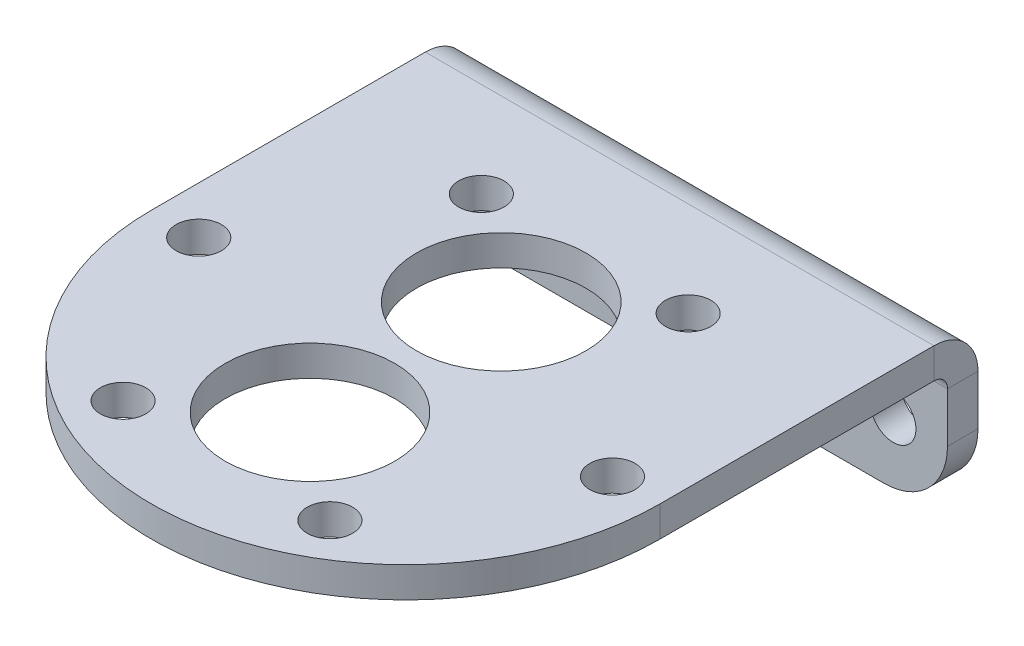
ISO-10303-21;
HEADER;
FILE_DESCRIPTION(('STEP AP214'),'2;1');
FILE_NAME('part.step','',(''),(''),'','','');
FILE_SCHEMA(('AUTOMOTIVE_DESIGN { 1 0 10303 214 1 1 1 1 }'));
ENDSEC;
DATA;
#1=APPLICATION_CONTEXT('core data for automotive mechanical design processes');
#2=APPLICATION_PROTOCOL_DEFINITION('international standard','automotive_design',2000,#1);
#3=PRODUCT_CONTEXT('',#1,'mechanical');
#4=PRODUCT('Part','Part','',(#3));
#5=PRODUCT_RELATED_PRODUCT_CATEGORY('part','',(#4));
#6=PRODUCT_DEFINITION_FORMATION('','',#4);
#7=PRODUCT_DEFINITION_CONTEXT('part definition',#1,'design');
#8=PRODUCT_DEFINITION('design','',#6,#7);
#9=PRODUCT_DEFINITION_SHAPE('','',#8);
#10=(LENGTH_UNIT() NAMED_UNIT(*) SI_UNIT(.MILLI.,.METRE.));
#11=(NAMED_UNIT(*) PLANE_ANGLE_UNIT() SI_UNIT($,.RADIAN.));
#12=(NAMED_UNIT(*) SI_UNIT($,.STERADIAN.) SOLID_ANGLE_UNIT());
#13=UNCERTAINTY_MEASURE_WITH_UNIT(LENGTH_MEASURE(1.E-05),#10,'distance_accuracy_value','');
#14=(GEOMETRIC_REPRESENTATION_CONTEXT(3) GLOBAL_UNCERTAINTY_ASSIGNED_CONTEXT((#13)) GLOBAL_UNIT_ASSIGNED_CONTEXT((#10,
#11,#12)) REPRESENTATION_CONTEXT('',''));
#15=CARTESIAN_POINT('',(0.,0.,0.));
#16=DIRECTION('',(0.,0.,1.));
#17=DIRECTION('',(1.,0.,0.));
#18=AXIS2_PLACEMENT_3D('',#15,#16,#17);
#19=CARTESIAN_POINT('',(19.05,-2.286,0.));
#20=DIRECTION('',(1.,0.,0.));
#21=DIRECTION('',(0.,0.,-1.));
#22=AXIS2_PLACEMENT_3D('',#19,#20,#21);
#23=PLANE('',#22);
#24=DIRECTION('',(0.,0.,-1.));
#25=VECTOR('',#24,1.);
#26=CARTESIAN_POINT('',(19.05,-2.286,0.));
#27=LINE('',#26,#25);
#28=CARTESIAN_POINT('',(19.05,-2.286,0.));
#29=VERTEX_POINT('',#28);
#30=CARTESIAN_POINT('',(19.05,-2.28600000000001,-20.5232));
#31=VERTEX_POINT('',#30);
#32=EDGE_CURVE('E201',#29,#31,#27,.T.);
#33=ORIENTED_EDGE('',*,*,#32,.T.);
#34=DIRECTION('',(0.,1.,0.));
#35=VECTOR('',#34,1.);
#36=CARTESIAN_POINT('',(19.05,-2.28600000000001,-20.5232));
#37=LINE('',#36,#35);
#38=CARTESIAN_POINT('',(19.05,0.,-20.5232));
#39=VERTEX_POINT('',#38);
#40=EDGE_CURVE('E186',#31,#39,#37,.T.);
#41=ORIENTED_EDGE('',*,*,#40,.T.);
#42=DIRECTION('',(0.,0.,-1.));
#43=VECTOR('',#42,1.);
#44=CARTESIAN_POINT('',(19.05,0.,0.));
#45=LINE('',#44,#43);
#46=CARTESIAN_POINT('',(19.05,0.,0.));
#47=VERTEX_POINT('',#46);
#48=EDGE_CURVE('E210',#47,#39,#45,.T.);
#49=ORIENTED_EDGE('',*,*,#48,.F.);
#50=DIRECTION('',(0.,1.,0.));
#51=VECTOR('',#50,1.);
#52=CARTESIAN_POINT('',(19.05,-2.286,0.));
#53=LINE('',#52,#51);
#54=EDGE_CURVE('E207',#29,#47,#53,.T.);
#55=ORIENTED_EDGE('',*,*,#54,.F.);
#56=EDGE_LOOP('',(#33,#41,#49,#55));
#57=FACE_BOUND('',#56,.T.);
#58=ADVANCED_FACE('F59',(#57),#23,.T.);
#59=CARTESIAN_POINT('',(0.,-2.286,0.));
#60=DIRECTION('',(0.,1.,0.));
#61=DIRECTION('',(0.,0.,1.));
#62=AXIS2_PLACEMENT_3D('',#59,#60,#61);
#63=PLANE('',#62);
#64=CARTESIAN_POINT('',(0.,-2.286,7.1628));
#65=DIRECTION('',(0.,-1.,0.));
#66=DIRECTION('',(0.,0.,-1.));
#67=AXIS2_PLACEMENT_3D('',#64,#65,#66);
#68=CIRCLE('',#67,6.35);
#69=CARTESIAN_POINT('',(0.,-2.286,0.812800000000004));
#70=VERTEX_POINT('',#69);
#71=EDGE_CURVE('E227',#70,#70,#68,.T.);
#72=ORIENTED_EDGE('',*,*,#71,.F.);
#73=EDGE_LOOP('',(#72));
#74=FACE_BOUND('',#73,.T.);
#75=CARTESIAN_POINT('',(0.,-2.286,-7.1628));
#76=DIRECTION('',(0.,-1.,0.));
#77=DIRECTION('',(0.,0.,-1.));
#78=AXIS2_PLACEMENT_3D('',#75,#76,#77);
#79=CIRCLE('',#78,6.35);
#80=CARTESIAN_POINT('',(0.,-2.286,-13.5128));
#81=VERTEX_POINT('',#80);
#82=EDGE_CURVE('E223',#81,#81,#79,.T.);
#83=ORIENTED_EDGE('',*,*,#82,.F.);
#84=EDGE_LOOP('',(#83));
#85=FACE_BOUND('',#84,.T.);
#86=CARTESIAN_POINT('',(7.74699999999999,-2.286,13.4181976062361));
#87=DIRECTION('',(0.,1.,0.));
#88=DIRECTION('',(0.,0.,1.));
#89=AXIS2_PLACEMENT_3D('',#86,#87,#88);
#90=CIRCLE('',#89,1.7);
#91=CARTESIAN_POINT('',(7.74699999999999,-2.286,15.1181976062361));
#92=VERTEX_POINT('',#91);
#93=EDGE_CURVE('E410',#92,#92,#90,.T.);
#94=ORIENTED_EDGE('',*,*,#93,.T.);
#95=EDGE_LOOP('',(#94));
#96=FACE_BOUND('',#95,.T.);
#97=CARTESIAN_POINT('',(-7.74700000000001,-2.286,13.4181976062361));
#98=DIRECTION('',(0.,1.,0.));
#99=DIRECTION('',(0.,0.,1.));
#100=AXIS2_PLACEMENT_3D('',#97,#98,#99);
#101=CIRCLE('',#100,1.7);
#102=CARTESIAN_POINT('',(-7.74700000000001,-2.286,15.1181976062361));
#103=VERTEX_POINT('',#102);
#104=EDGE_CURVE('E406',#103,#103,#101,.T.);
#105=ORIENTED_EDGE('',*,*,#104,.T.);
#106=EDGE_LOOP('',(#105));
#107=FACE_BOUND('',#106,.T.);
#108=CARTESIAN_POINT('',(-15.494,-2.286,0.));
#109=DIRECTION('',(0.,1.,0.));
#110=DIRECTION('',(0.,0.,1.));
#111=AXIS2_PLACEMENT_3D('',#108,#109,#110);
#112=CIRCLE('',#111,1.7);
#113=CARTESIAN_POINT('',(-15.494,-2.286,1.7));
#114=VERTEX_POINT('',#113);
#115=EDGE_CURVE('E402',#114,#114,#112,.T.);
#116=ORIENTED_EDGE('',*,*,#115,.T.);
#117=EDGE_LOOP('',(#116));
#118=FACE_BOUND('',#117,.T.);
#119=CARTESIAN_POINT('',(-7.747,-2.286,-13.4181976062361));
#120=DIRECTION('',(0.,1.,0.));
#121=DIRECTION('',(0.,0.,1.));
#122=AXIS2_PLACEMENT_3D('',#119,#120,#121);
#123=CIRCLE('',#122,1.7);
#124=CARTESIAN_POINT('',(-7.747,-2.286,-11.7181976062361));
#125=VERTEX_POINT('',#124);
#126=EDGE_CURVE('E398',#125,#125,#123,.T.);
#127=ORIENTED_EDGE('',*,*,#126,.T.);
#128=EDGE_LOOP('',(#127));
#129=FACE_BOUND('',#128,.T.);
#130=CARTESIAN_POINT('',(7.747,-2.286,-13.4181976062361));
#131=DIRECTION('',(0.,1.,0.));
#132=DIRECTION('',(0.,0.,1.));
#133=AXIS2_PLACEMENT_3D('',#130,#131,#132);
#134=CIRCLE('',#133,1.7);
#135=CARTESIAN_POINT('',(7.747,-2.286,-11.7181976062361));
#136=VERTEX_POINT('',#135);
#137=EDGE_CURVE('E391',#136,#136,#134,.T.);
#138=ORIENTED_EDGE('',*,*,#137,.T.);
#139=EDGE_LOOP('',(#138));
#140=FACE_BOUND('',#139,.T.);
#141=CARTESIAN_POINT('',(15.494,-2.286,0.));
#142=DIRECTION('',(0.,1.,0.));
#143=DIRECTION('',(0.,0.,1.));
#144=AXIS2_PLACEMENT_3D('',#141,#142,#143);
#145=CIRCLE('',#144,1.7);
#146=CARTESIAN_POINT('',(15.494,-2.286,1.7));
#147=VERTEX_POINT('',#146);
#148=EDGE_CURVE('E183',#147,#147,#145,.T.);
#149=ORIENTED_EDGE('',*,*,#148,.T.);
#150=EDGE_LOOP('',(#149));
#151=FACE_BOUND('',#150,.T.);
#152=DIRECTION('',(1.,0.,0.));
#153=VECTOR('',#152,1.);
#154=CARTESIAN_POINT('',(19.05,-2.28600000000001,-20.5232));
#155=LINE('',#154,#153);
#156=CARTESIAN_POINT('',(-19.05,-2.286,-20.5232));
#157=VERTEX_POINT('',#156);
#158=EDGE_CURVE('E190',#31,#157,#155,.F.);
#159=ORIENTED_EDGE('',*,*,#158,.F.);
#160=ORIENTED_EDGE('',*,*,#32,.F.);
#161=CARTESIAN_POINT('',(0.,-2.286,0.));
#162=DIRECTION('',(0.,1.,0.));
#163=DIRECTION('',(0.,0.,1.));
#164=AXIS2_PLACEMENT_3D('',#161,#162,#163);
#165=CIRCLE('',#164,19.05);
#166=CARTESIAN_POINT('',(-19.05,-2.286,0.));
#167=VERTEX_POINT('',#166);
#168=EDGE_CURVE('E198',#167,#29,#165,.T.);
#169=ORIENTED_EDGE('',*,*,#168,.F.);
#170=DIRECTION('',(0.,0.,1.));
#171=VECTOR('',#170,1.);
#172=CARTESIAN_POINT('',(-19.05,-2.286,-23.8252));
#173=LINE('',#172,#171);
#174=EDGE_CURVE('E205',#157,#167,#173,.T.);
#175=ORIENTED_EDGE('',*,*,#174,.F.);
#176=EDGE_LOOP('',(#159,#160,#169,#175));
#177=FACE_BOUND('',#176,.T.);
#178=ADVANCED_FACE('F273',(#74,#85,#96,#107,#118,#129,#140,#151,#177),#63,.F.);
#179=CARTESIAN_POINT('',(0.,0.,0.));
#180=DIRECTION('',(0.,1.,0.));
#181=DIRECTION('',(0.,0.,1.));
#182=AXIS2_PLACEMENT_3D('',#179,#180,#181);
#183=PLANE('',#182);
#184=CARTESIAN_POINT('',(0.,0.,7.1628));
#185=DIRECTION('',(0.,1.,0.));
#186=DIRECTION('',(0.,0.,1.));
#187=AXIS2_PLACEMENT_3D('',#184,#185,#186);
#188=CIRCLE('',#187,6.35);
#189=CARTESIAN_POINT('',(0.,0.,13.5128));
#190=VERTEX_POINT('',#189);
#191=EDGE_CURVE('E224',#190,#190,#188,.T.);
#192=ORIENTED_EDGE('',*,*,#191,.F.);
#193=EDGE_LOOP('',(#192));
#194=FACE_BOUND('',#193,.T.);
#195=CARTESIAN_POINT('',(0.,0.,-7.1628));
#196=DIRECTION('',(0.,1.,0.));
#197=DIRECTION('',(0.,0.,1.));
#198=AXIS2_PLACEMENT_3D('',#195,#196,#197);
#199=CIRCLE('',#198,6.35);
#200=CARTESIAN_POINT('',(0.,0.,-0.812800000000004));
#201=VERTEX_POINT('',#200);
#202=EDGE_CURVE('E219',#201,#201,#199,.T.);
#203=ORIENTED_EDGE('',*,*,#202,.F.);
#204=EDGE_LOOP('',(#203));
#205=FACE_BOUND('',#204,.T.);
#206=CARTESIAN_POINT('',(7.74699999999999,0.,13.4181976062361));
#207=DIRECTION('',(0.,1.,0.));
#208=DIRECTION('',(0.,0.,1.));
#209=AXIS2_PLACEMENT_3D('',#206,#207,#208);
#210=CIRCLE('',#209,1.7);
#211=CARTESIAN_POINT('',(7.74699999999999,0.,15.1181976062361));
#212=VERTEX_POINT('',#211);
#213=EDGE_CURVE('E222',#212,#212,#210,.T.);
#214=ORIENTED_EDGE('',*,*,#213,.F.);
#215=EDGE_LOOP('',(#214));
#216=FACE_BOUND('',#215,.T.);
#217=CARTESIAN_POINT('',(-7.74700000000001,0.,13.4181976062361));
#218=DIRECTION('',(0.,1.,0.));
#219=DIRECTION('',(0.,0.,1.));
#220=AXIS2_PLACEMENT_3D('',#217,#218,#219);
#221=CIRCLE('',#220,1.7);
#222=CARTESIAN_POINT('',(-7.74700000000001,0.,15.1181976062361));
#223=VERTEX_POINT('',#222);
#224=EDGE_CURVE('E375',#223,#223,#221,.T.);
#225=ORIENTED_EDGE('',*,*,#224,.F.);
#226=EDGE_LOOP('',(#225));
#227=FACE_BOUND('',#226,.T.);
#228=CARTESIAN_POINT('',(-15.494,0.,0.));
#229=DIRECTION('',(0.,1.,0.));
#230=DIRECTION('',(0.,0.,1.));
#231=AXIS2_PLACEMENT_3D('',#228,#229,#230);
#232=CIRCLE('',#231,1.7);
#233=CARTESIAN_POINT('',(-15.494,0.,1.7));
#234=VERTEX_POINT('',#233);
#235=EDGE_CURVE('E379',#234,#234,#232,.T.);
#236=ORIENTED_EDGE('',*,*,#235,.F.);
#237=EDGE_LOOP('',(#236));
#238=FACE_BOUND('',#237,.T.);
#239=CARTESIAN_POINT('',(-7.747,0.,-13.4181976062361));
#240=DIRECTION('',(0.,1.,0.));
#241=DIRECTION('',(0.,0.,1.));
#242=AXIS2_PLACEMENT_3D('',#239,#240,#241);
#243=CIRCLE('',#242,1.7);
#244=CARTESIAN_POINT('',(-7.747,0.,-11.7181976062361));
#245=VERTEX_POINT('',#244);
#246=EDGE_CURVE('E383',#245,#245,#243,.T.);
#247=ORIENTED_EDGE('',*,*,#246,.F.);
#248=EDGE_LOOP('',(#247));
#249=FACE_BOUND('',#248,.T.);
#250=CARTESIAN_POINT('',(7.747,0.,-13.4181976062361));
#251=DIRECTION('',(0.,1.,0.));
#252=DIRECTION('',(0.,0.,1.));
#253=AXIS2_PLACEMENT_3D('',#250,#251,#252);
#254=CIRCLE('',#253,1.7);
#255=CARTESIAN_POINT('',(7.747,0.,-11.7181976062361));
#256=VERTEX_POINT('',#255);
#257=EDGE_CURVE('E387',#256,#256,#254,.T.);
#258=ORIENTED_EDGE('',*,*,#257,.F.);
#259=EDGE_LOOP('',(#258));
#260=FACE_BOUND('',#259,.T.);
#261=CARTESIAN_POINT('',(15.494,0.,0.));
#262=DIRECTION('',(0.,1.,0.));
#263=DIRECTION('',(0.,0.,1.));
#264=AXIS2_PLACEMENT_3D('',#261,#262,#263);
#265=CIRCLE('',#264,1.7);
#266=CARTESIAN_POINT('',(15.494,0.,1.7));
#267=VERTEX_POINT('',#266);
#268=EDGE_CURVE('E390',#267,#267,#265,.T.);
#269=ORIENTED_EDGE('',*,*,#268,.F.);
#270=EDGE_LOOP('',(#269));
#271=FACE_BOUND('',#270,.T.);
#272=ORIENTED_EDGE('',*,*,#48,.T.);
#273=DIRECTION('',(1.,0.,0.));
#274=VECTOR('',#273,1.);
#275=CARTESIAN_POINT('',(19.05,0.,-20.5232));
#276=LINE('',#275,#274);
#277=CARTESIAN_POINT('',(-19.05,0.,-20.5232));
#278=VERTEX_POINT('',#277);
#279=EDGE_CURVE('E145',#39,#278,#276,.F.);
#280=ORIENTED_EDGE('',*,*,#279,.T.);
#281=DIRECTION('',(0.,0.,1.));
#282=VECTOR('',#281,1.);
#283=CARTESIAN_POINT('',(-19.05,0.,-23.8252));
#284=LINE('',#283,#282);
#285=CARTESIAN_POINT('',(-19.05,0.,0.));
#286=VERTEX_POINT('',#285);
#287=EDGE_CURVE('E202',#278,#286,#284,.T.);
#288=ORIENTED_EDGE('',*,*,#287,.T.);
#289=CARTESIAN_POINT('',(0.,0.,0.));
#290=DIRECTION('',(0.,1.,0.));
#291=DIRECTION('',(0.,0.,1.));
#292=AXIS2_PLACEMENT_3D('',#289,#290,#291);
#293=CIRCLE('',#292,19.05);
#294=EDGE_CURVE('E196',#286,#47,#293,.T.);
#295=ORIENTED_EDGE('',*,*,#294,.T.);
#296=EDGE_LOOP('',(#272,#280,#288,#295));
#297=FACE_BOUND('',#296,.T.);
#298=ADVANCED_FACE('F280',(#194,#205,#216,#227,#238,#249,#260,#271,#297),#183,.T.);
#299=CARTESIAN_POINT('',(0.,-2.286,0.));
#300=DIRECTION('',(0.,1.,0.));
#301=DIRECTION('',(0.,0.,1.));
#302=AXIS2_PLACEMENT_3D('',#299,#300,#301);
#303=CYLINDRICAL_SURFACE('',#302,19.05);
#304=ORIENTED_EDGE('',*,*,#294,.F.);
#305=DIRECTION('',(0.,1.,0.));
#306=VECTOR('',#305,1.);
#307=CARTESIAN_POINT('',(-19.05,-2.286,0.));
#308=LINE('',#307,#306);
#309=EDGE_CURVE('E214',#167,#286,#308,.T.);
#310=ORIENTED_EDGE('',*,*,#309,.F.);
#311=ORIENTED_EDGE('',*,*,#168,.T.);
#312=ORIENTED_EDGE('',*,*,#54,.T.);
#313=EDGE_LOOP('',(#304,#310,#311,#312));
#314=FACE_BOUND('',#313,.T.);
#315=ADVANCED_FACE('F277',(#314),#303,.T.);
#316=CARTESIAN_POINT('',(-19.05,-2.286,-23.8252));
#317=DIRECTION('',(-1.,0.,0.));
#318=DIRECTION('',(0.,0.,1.));
#319=AXIS2_PLACEMENT_3D('',#316,#317,#318);
#320=PLANE('',#319);
#321=DIRECTION('',(0.,1.,0.));
#322=VECTOR('',#321,1.);
#323=CARTESIAN_POINT('',(-19.05,-2.286,-20.5232));
#324=LINE('',#323,#322);
#325=EDGE_CURVE('E193',#157,#278,#324,.T.);
#326=ORIENTED_EDGE('',*,*,#325,.F.);
#327=ORIENTED_EDGE('',*,*,#174,.T.);
#328=ORIENTED_EDGE('',*,*,#309,.T.);
#329=ORIENTED_EDGE('',*,*,#287,.F.);
#330=EDGE_LOOP('',(#326,#327,#328,#329));
#331=FACE_BOUND('',#330,.T.);
#332=ADVANCED_FACE('F269',(#331),#320,.T.);
#333=CARTESIAN_POINT('',(-19.05,-3.302,-20.5232));
#334=DIRECTION('',(-1.,0.,0.));
#335=DIRECTION('',(0.,-1.,0.));
#336=AXIS2_PLACEMENT_3D('',#333,#334,#335);
#337=PLANE('',#336);
#338=DIRECTION('',(0.,0.,1.));
#339=VECTOR('',#338,1.);
#340=CARTESIAN_POINT('',(-19.05,-3.30199999999998,-23.8252));
#341=LINE('',#340,#339);
#342=CARTESIAN_POINT('',(-19.05,-3.30199999999999,-21.5392));
#343=VERTEX_POINT('',#342);
#344=CARTESIAN_POINT('',(-19.05,-3.30199999999998,-23.8252));
#345=VERTEX_POINT('',#344);
#346=EDGE_CURVE('E180',#343,#345,#341,.F.);
#347=ORIENTED_EDGE('',*,*,#346,.F.);
#348=CARTESIAN_POINT('',(-19.05,-3.302,-20.5232));
#349=DIRECTION('',(1.,0.,0.));
#350=DIRECTION('',(0.,1.,0.));
#351=AXIS2_PLACEMENT_3D('',#348,#349,#350);
#352=CIRCLE('',#351,1.016);
#353=EDGE_CURVE('E148',#157,#343,#352,.F.);
#354=ORIENTED_EDGE('',*,*,#353,.F.);
#355=ORIENTED_EDGE('',*,*,#325,.T.);
#356=CARTESIAN_POINT('',(-19.05,-3.302,-20.5232));
#357=DIRECTION('',(1.,0.,0.));
#358=DIRECTION('',(0.,1.,0.));
#359=AXIS2_PLACEMENT_3D('',#356,#357,#358);
#360=CIRCLE('',#359,3.302);
#361=EDGE_CURVE('E185',#278,#345,#360,.F.);
#362=ORIENTED_EDGE('',*,*,#361,.T.);
#363=EDGE_LOOP('',(#347,#354,#355,#362));
#364=FACE_BOUND('',#363,.T.);
#365=ADVANCED_FACE('F265',(#364),#337,.T.);
#366=CARTESIAN_POINT('',(19.05,-3.30200000000001,-20.5232));
#367=DIRECTION('',(-1.,0.,0.));
#368=DIRECTION('',(0.,-1.,0.));
#369=AXIS2_PLACEMENT_3D('',#366,#367,#368);
#370=PLANE('',#369);
#371=CARTESIAN_POINT('',(19.05,-3.30200000000001,-20.5232));
#372=DIRECTION('',(1.,0.,0.));
#373=DIRECTION('',(0.,1.,0.));
#374=AXIS2_PLACEMENT_3D('',#371,#372,#373);
#375=CIRCLE('',#374,1.016);
#376=CARTESIAN_POINT('',(19.05,-3.302,-21.5392));
#377=VERTEX_POINT('',#376);
#378=EDGE_CURVE('E155',#377,#31,#375,.T.);
#379=ORIENTED_EDGE('',*,*,#378,.F.);
#380=DIRECTION('',(0.,0.,1.));
#381=VECTOR('',#380,1.);
#382=CARTESIAN_POINT('',(19.05,-3.302,-21.5392));
#383=LINE('',#382,#381);
#384=CARTESIAN_POINT('',(19.05,-3.30199999999998,-23.8252));
#385=VERTEX_POINT('',#384);
#386=EDGE_CURVE('E152',#377,#385,#383,.F.);
#387=ORIENTED_EDGE('',*,*,#386,.T.);
#388=CARTESIAN_POINT('',(19.05,-3.30200000000001,-20.5232));
#389=DIRECTION('',(1.,0.,0.));
#390=DIRECTION('',(0.,1.,0.));
#391=AXIS2_PLACEMENT_3D('',#388,#389,#390);
#392=CIRCLE('',#391,3.302);
#393=EDGE_CURVE('E138',#385,#39,#392,.T.);
#394=ORIENTED_EDGE('',*,*,#393,.T.);
#395=ORIENTED_EDGE('',*,*,#40,.F.);
#396=EDGE_LOOP('',(#379,#387,#394,#395));
#397=FACE_BOUND('',#396,.T.);
#398=ADVANCED_FACE('F153',(#397),#370,.F.);
#399=CARTESIAN_POINT('',(19.05,-3.30200000000001,-20.5232));
#400=DIRECTION('',(1.,0.,0.));
#401=DIRECTION('',(0.,0.,-1.));
#402=AXIS2_PLACEMENT_3D('',#399,#400,#401);
#403=CYLINDRICAL_SURFACE('',#402,3.302);
#404=ORIENTED_EDGE('',*,*,#279,.F.);
#405=ORIENTED_EDGE('',*,*,#393,.F.);
#406=DIRECTION('',(1.,0.,0.));
#407=VECTOR('',#406,1.);
#408=CARTESIAN_POINT('',(0.,-3.30199999999998,-23.8252));
#409=LINE('',#408,#407);
#410=EDGE_CURVE('E142',#345,#385,#409,.T.);
#411=ORIENTED_EDGE('',*,*,#410,.F.);
#412=ORIENTED_EDGE('',*,*,#361,.F.);
#413=EDGE_LOOP('',(#404,#405,#411,#412));
#414=FACE_BOUND('',#413,.T.);
#415=ADVANCED_FACE('F140',(#414),#403,.T.);
#416=CARTESIAN_POINT('',(19.05,-3.30200000000001,-20.5232));
#417=DIRECTION('',(1.,0.,0.));
#418=DIRECTION('',(0.,0.,-1.));
#419=AXIS2_PLACEMENT_3D('',#416,#417,#418);
#420=CYLINDRICAL_SURFACE('',#419,1.016);
#421=ORIENTED_EDGE('',*,*,#158,.T.);
#422=ORIENTED_EDGE('',*,*,#353,.T.);
#423=DIRECTION('',(-1.,0.,0.));
#424=VECTOR('',#423,1.);
#425=CARTESIAN_POINT('',(-19.05,-3.30199999999999,-21.5392));
#426=LINE('',#425,#424);
#427=EDGE_CURVE('E157',#343,#377,#426,.F.);
#428=ORIENTED_EDGE('',*,*,#427,.T.);
#429=ORIENTED_EDGE('',*,*,#378,.T.);
#430=EDGE_LOOP('',(#421,#422,#428,#429));
#431=FACE_BOUND('',#430,.T.);
#432=ADVANCED_FACE('F260',(#431),#420,.F.);
#433=CARTESIAN_POINT('',(-19.05,-11.811,-23.8252000000001));
#434=DIRECTION('',(1.,0.,0.));
#435=DIRECTION('',(0.,0.,-1.));
#436=AXIS2_PLACEMENT_3D('',#433,#434,#435);
#437=PLANE('',#436);
#438=DIRECTION('',(0.,-1.,0.));
#439=VECTOR('',#438,1.);
#440=CARTESIAN_POINT('',(-19.05,1.71803815408234E-13,-23.8252));
#441=LINE('',#440,#439);
#442=CARTESIAN_POINT('',(-19.05,-7.03579999999998,-23.8252));
#443=VERTEX_POINT('',#442);
#444=EDGE_CURVE('E164',#443,#345,#441,.F.);
#445=ORIENTED_EDGE('',*,*,#444,.F.);
#446=DIRECTION('',(0.,0.,1.));
#447=VECTOR('',#446,1.);
#448=CARTESIAN_POINT('',(-19.05,-7.03579999999998,-23.8252));
#449=LINE('',#448,#447);
#450=CARTESIAN_POINT('',(-19.05,-7.03579999999999,-21.5392));
#451=VERTEX_POINT('',#450);
#452=EDGE_CURVE('E217',#443,#451,#449,.T.);
#453=ORIENTED_EDGE('',*,*,#452,.T.);
#454=DIRECTION('',(0.,1.,0.));
#455=VECTOR('',#454,1.);
#456=CARTESIAN_POINT('',(-19.05,-11.811,-21.5392000000001));
#457=LINE('',#456,#455);
#458=EDGE_CURVE('E165',#451,#343,#457,.T.);
#459=ORIENTED_EDGE('',*,*,#458,.T.);
#460=ORIENTED_EDGE('',*,*,#346,.T.);
#461=EDGE_LOOP('',(#445,#453,#459,#460));
#462=FACE_BOUND('',#461,.T.);
#463=ADVANCED_FACE('F248',(#462),#437,.F.);
#464=CARTESIAN_POINT('',(19.05,-2.28599999999999,-23.8252));
#465=DIRECTION('',(-1.,0.,0.));
#466=DIRECTION('',(0.,-1.,0.));
#467=AXIS2_PLACEMENT_3D('',#464,#465,#466);
#468=PLANE('',#467);
#469=DIRECTION('',(0.,-1.,0.));
#470=VECTOR('',#469,1.);
#471=CARTESIAN_POINT('',(19.05,-2.286,-21.5392));
#472=LINE('',#471,#470);
#473=CARTESIAN_POINT('',(19.05,-7.0358,-21.5392));
#474=VERTEX_POINT('',#473);
#475=EDGE_CURVE('E176',#377,#474,#472,.T.);
#476=ORIENTED_EDGE('',*,*,#475,.T.);
#477=DIRECTION('',(0.,0.,1.));
#478=VECTOR('',#477,1.);
#479=CARTESIAN_POINT('',(19.05,-7.03579999999999,-23.8252));
#480=LINE('',#479,#478);
#481=CARTESIAN_POINT('',(19.05,-7.03579999999999,-23.8252));
#482=VERTEX_POINT('',#481);
#483=EDGE_CURVE('E13',#474,#482,#480,.F.);
#484=ORIENTED_EDGE('',*,*,#483,.T.);
#485=DIRECTION('',(0.,1.,0.));
#486=VECTOR('',#485,1.);
#487=CARTESIAN_POINT('',(19.05,1.78742709312142E-13,-23.8252));
#488=LINE('',#487,#486);
#489=EDGE_CURVE('E161',#385,#482,#488,.F.);
#490=ORIENTED_EDGE('',*,*,#489,.F.);
#491=ORIENTED_EDGE('',*,*,#386,.F.);
#492=EDGE_LOOP('',(#476,#484,#490,#491));
#493=FACE_BOUND('',#492,.T.);
#494=ADVANCED_FACE('F167',(#493),#468,.F.);
#495=CARTESIAN_POINT('',(0.,1.71803815408234E-13,-23.8252));
#496=DIRECTION('',(0.,0.,-1.));
#497=DIRECTION('',(0.,1.,0.));
#498=AXIS2_PLACEMENT_3D('',#495,#496,#497);
#499=PLANE('',#498);
#500=CARTESIAN_POINT('',(14.986,-7.112,-23.8252));
#501=DIRECTION('',(0.,0.,-1.));
#502=DIRECTION('',(0.,1.,0.));
#503=AXIS2_PLACEMENT_3D('',#500,#501,#502);
#504=CIRCLE('',#503,1.7);
#505=CARTESIAN_POINT('',(14.986,-5.412,-23.8252));
#506=VERTEX_POINT('',#505);
#507=EDGE_CURVE('E232',#506,#506,#504,.T.);
#508=ORIENTED_EDGE('',*,*,#507,.F.);
#509=EDGE_LOOP('',(#508));
#510=FACE_BOUND('',#509,.T.);
#511=CARTESIAN_POINT('',(-14.986,-7.112,-23.8252));
#512=DIRECTION('',(0.,0.,-1.));
#513=DIRECTION('',(0.,1.,0.));
#514=AXIS2_PLACEMENT_3D('',#511,#512,#513);
#515=CIRCLE('',#514,1.7);
#516=CARTESIAN_POINT('',(-14.986,-5.412,-23.8252));
#517=VERTEX_POINT('',#516);
#518=EDGE_CURVE('E231',#517,#517,#515,.T.);
#519=ORIENTED_EDGE('',*,*,#518,.F.);
#520=EDGE_LOOP('',(#519));
#521=FACE_BOUND('',#520,.T.);
#522=DIRECTION('',(1.,0.,0.));
#523=VECTOR('',#522,1.);
#524=CARTESIAN_POINT('',(0.,-11.811,-23.8252000000001));
#525=LINE('',#524,#523);
#526=CARTESIAN_POINT('',(14.2748,-11.811,-23.8252000000001));
#527=VERTEX_POINT('',#526);
#528=CARTESIAN_POINT('',(-14.2748,-11.811,-23.8252000000001));
#529=VERTEX_POINT('',#528);
#530=EDGE_CURVE('E168',#527,#529,#525,.F.);
#531=ORIENTED_EDGE('',*,*,#530,.T.);
#532=CARTESIAN_POINT('',(-14.2748,-7.03579999999998,-23.8252));
#533=DIRECTION('',(0.,0.,-1.));
#534=DIRECTION('',(0.,1.,0.));
#535=AXIS2_PLACEMENT_3D('',#532,#533,#534);
#536=CIRCLE('',#535,4.7752);
#537=EDGE_CURVE('E67',#529,#443,#536,.T.);
#538=ORIENTED_EDGE('',*,*,#537,.T.);
#539=ORIENTED_EDGE('',*,*,#444,.T.);
#540=ORIENTED_EDGE('',*,*,#410,.T.);
#541=ORIENTED_EDGE('',*,*,#489,.T.);
#542=CARTESIAN_POINT('',(14.2748,-7.03579999999999,-23.8252));
#543=DIRECTION('',(0.,0.,-1.));
#544=DIRECTION('',(0.,1.,0.));
#545=AXIS2_PLACEMENT_3D('',#542,#543,#544);
#546=CIRCLE('',#545,4.7752);
#547=EDGE_CURVE('E243',#482,#527,#546,.T.);
#548=ORIENTED_EDGE('',*,*,#547,.T.);
#549=EDGE_LOOP('',(#531,#538,#539,#540,#541,#548));
#550=FACE_BOUND('',#549,.T.);
#551=ADVANCED_FACE('F160',(#510,#521,#550),#499,.T.);
#552=CARTESIAN_POINT('',(0.,1.5620837956476E-13,-21.5392));
#553=DIRECTION('',(0.,0.,-1.));
#554=DIRECTION('',(0.,1.,0.));
#555=AXIS2_PLACEMENT_3D('',#552,#553,#554);
#556=PLANE('',#555);
#557=CARTESIAN_POINT('',(14.986,-7.11200000000002,-21.5392));
#558=DIRECTION('',(0.,0.,-1.));
#559=DIRECTION('',(0.,1.,0.));
#560=AXIS2_PLACEMENT_3D('',#557,#558,#559);
#561=CIRCLE('',#560,1.7);
#562=CARTESIAN_POINT('',(14.986,-5.41200000000002,-21.5392));
#563=VERTEX_POINT('',#562);
#564=EDGE_CURVE('E228',#563,#563,#561,.T.);
#565=ORIENTED_EDGE('',*,*,#564,.T.);
#566=EDGE_LOOP('',(#565));
#567=FACE_BOUND('',#566,.T.);
#568=CARTESIAN_POINT('',(-14.986,-7.11200000000002,-21.5392));
#569=DIRECTION('',(0.,0.,-1.));
#570=DIRECTION('',(0.,1.,0.));
#571=AXIS2_PLACEMENT_3D('',#568,#569,#570);
#572=CIRCLE('',#571,1.7);
#573=CARTESIAN_POINT('',(-14.986,-5.41200000000002,-21.5392));
#574=VERTEX_POINT('',#573);
#575=EDGE_CURVE('E418',#574,#574,#572,.T.);
#576=ORIENTED_EDGE('',*,*,#575,.T.);
#577=EDGE_LOOP('',(#576));
#578=FACE_BOUND('',#577,.T.);
#579=ORIENTED_EDGE('',*,*,#458,.F.);
#580=CARTESIAN_POINT('',(-14.2748,-7.03579999999999,-21.5392));
#581=DIRECTION('',(0.,0.,-1.));
#582=DIRECTION('',(0.,1.,0.));
#583=AXIS2_PLACEMENT_3D('',#580,#581,#582);
#584=CIRCLE('',#583,4.7752);
#585=CARTESIAN_POINT('',(-14.2748,-11.811,-21.5392000000001));
#586=VERTEX_POINT('',#585);
#587=EDGE_CURVE('E237',#451,#586,#584,.F.);
#588=ORIENTED_EDGE('',*,*,#587,.T.);
#589=DIRECTION('',(-1.,0.,0.));
#590=VECTOR('',#589,1.);
#591=CARTESIAN_POINT('',(19.05,-11.811,-21.5392000000001));
#592=LINE('',#591,#590);
#593=CARTESIAN_POINT('',(14.2748,-11.811,-21.5392000000001));
#594=VERTEX_POINT('',#593);
#595=EDGE_CURVE('E171',#594,#586,#592,.T.);
#596=ORIENTED_EDGE('',*,*,#595,.F.);
#597=CARTESIAN_POINT('',(14.2748,-7.0358,-21.5392));
#598=DIRECTION('',(0.,0.,-1.));
#599=DIRECTION('',(0.,1.,0.));
#600=AXIS2_PLACEMENT_3D('',#597,#598,#599);
#601=CIRCLE('',#600,4.7752);
#602=EDGE_CURVE('E235',#594,#474,#601,.F.);
#603=ORIENTED_EDGE('',*,*,#602,.T.);
#604=ORIENTED_EDGE('',*,*,#475,.F.);
#605=ORIENTED_EDGE('',*,*,#427,.F.);
#606=EDGE_LOOP('',(#579,#588,#596,#603,#604,#605));
#607=FACE_BOUND('',#606,.T.);
#608=ADVANCED_FACE('F254',(#567,#578,#607),#556,.F.);
#609=CARTESIAN_POINT('',(19.05,-11.811,-23.8252000000001));
#610=DIRECTION('',(0.,1.,0.));
#611=DIRECTION('',(0.,0.,1.));
#612=AXIS2_PLACEMENT_3D('',#609,#610,#611);
#613=PLANE('',#612);
#614=ORIENTED_EDGE('',*,*,#595,.T.);
#615=DIRECTION('',(0.,0.,1.));
#616=VECTOR('',#615,1.);
#617=CARTESIAN_POINT('',(-14.2748,-11.811,-23.8252000000001));
#618=LINE('',#617,#616);
#619=EDGE_CURVE('E80',#586,#529,#618,.F.);
#620=ORIENTED_EDGE('',*,*,#619,.T.);
#621=ORIENTED_EDGE('',*,*,#530,.F.);
#622=DIRECTION('',(0.,0.,1.));
#623=VECTOR('',#622,1.);
#624=CARTESIAN_POINT('',(14.2748,-11.811,-23.8252000000001));
#625=LINE('',#624,#623);
#626=EDGE_CURVE('E239',#527,#594,#625,.T.);
#627=ORIENTED_EDGE('',*,*,#626,.T.);
#628=EDGE_LOOP('',(#614,#620,#621,#627));
#629=FACE_BOUND('',#628,.T.);
#630=ADVANCED_FACE('F256',(#629),#613,.F.);
#631=CARTESIAN_POINT('',(15.494,0.,0.));
#632=DIRECTION('',(0.,1.,0.));
#633=DIRECTION('',(0.,0.,1.));
#634=AXIS2_PLACEMENT_3D('',#631,#632,#633);
#635=CYLINDRICAL_SURFACE('',#634,1.7);
#636=ORIENTED_EDGE('',*,*,#268,.T.);
#637=EDGE_LOOP('',(#636));
#638=FACE_BOUND('',#637,.T.);
#639=ORIENTED_EDGE('',*,*,#148,.F.);
#640=EDGE_LOOP('',(#639));
#641=FACE_BOUND('',#640,.T.);
#642=ADVANCED_FACE('F337',(#638,#641),#635,.F.);
#643=CARTESIAN_POINT('',(7.747,0.,-13.4181976062361));
#644=DIRECTION('',(0.,1.,0.));
#645=DIRECTION('',(0.,0.,1.));
#646=AXIS2_PLACEMENT_3D('',#643,#644,#645);
#647=CYLINDRICAL_SURFACE('',#646,1.7);
#648=ORIENTED_EDGE('',*,*,#257,.T.);
#649=EDGE_LOOP('',(#648));
#650=FACE_BOUND('',#649,.T.);
#651=ORIENTED_EDGE('',*,*,#137,.F.);
#652=EDGE_LOOP('',(#651));
#653=FACE_BOUND('',#652,.T.);
#654=ADVANCED_FACE('F333',(#650,#653),#647,.F.);
#655=CARTESIAN_POINT('',(-7.747,0.,-13.4181976062361));
#656=DIRECTION('',(0.,1.,0.));
#657=DIRECTION('',(0.,0.,1.));
#658=AXIS2_PLACEMENT_3D('',#655,#656,#657);
#659=CYLINDRICAL_SURFACE('',#658,1.7);
#660=ORIENTED_EDGE('',*,*,#246,.T.);
#661=EDGE_LOOP('',(#660));
#662=FACE_BOUND('',#661,.T.);
#663=ORIENTED_EDGE('',*,*,#126,.F.);
#664=EDGE_LOOP('',(#663));
#665=FACE_BOUND('',#664,.T.);
#666=ADVANCED_FACE('F329',(#662,#665),#659,.F.);
#667=CARTESIAN_POINT('',(-15.494,0.,0.));
#668=DIRECTION('',(0.,1.,0.));
#669=DIRECTION('',(0.,0.,1.));
#670=AXIS2_PLACEMENT_3D('',#667,#668,#669);
#671=CYLINDRICAL_SURFACE('',#670,1.7);
#672=ORIENTED_EDGE('',*,*,#235,.T.);
#673=EDGE_LOOP('',(#672));
#674=FACE_BOUND('',#673,.T.);
#675=ORIENTED_EDGE('',*,*,#115,.F.);
#676=EDGE_LOOP('',(#675));
#677=FACE_BOUND('',#676,.T.);
#678=ADVANCED_FACE('F325',(#674,#677),#671,.F.);
#679=CARTESIAN_POINT('',(-7.74700000000001,0.,13.4181976062361));
#680=DIRECTION('',(0.,1.,0.));
#681=DIRECTION('',(0.,0.,1.));
#682=AXIS2_PLACEMENT_3D('',#679,#680,#681);
#683=CYLINDRICAL_SURFACE('',#682,1.7);
#684=ORIENTED_EDGE('',*,*,#224,.T.);
#685=EDGE_LOOP('',(#684));
#686=FACE_BOUND('',#685,.T.);
#687=ORIENTED_EDGE('',*,*,#104,.F.);
#688=EDGE_LOOP('',(#687));
#689=FACE_BOUND('',#688,.T.);
#690=ADVANCED_FACE('F321',(#686,#689),#683,.F.);
#691=CARTESIAN_POINT('',(7.74699999999999,0.,13.4181976062361));
#692=DIRECTION('',(0.,1.,0.));
#693=DIRECTION('',(0.,0.,1.));
#694=AXIS2_PLACEMENT_3D('',#691,#692,#693);
#695=CYLINDRICAL_SURFACE('',#694,1.7);
#696=ORIENTED_EDGE('',*,*,#213,.T.);
#697=EDGE_LOOP('',(#696));
#698=FACE_BOUND('',#697,.T.);
#699=ORIENTED_EDGE('',*,*,#93,.F.);
#700=EDGE_LOOP('',(#699));
#701=FACE_BOUND('',#700,.T.);
#702=ADVANCED_FACE('F317',(#698,#701),#695,.F.);
#703=CARTESIAN_POINT('',(0.,0.254,-7.1628));
#704=DIRECTION('',(0.,-1.,0.));
#705=DIRECTION('',(0.,0.,-1.));
#706=AXIS2_PLACEMENT_3D('',#703,#704,#705);
#707=CYLINDRICAL_SURFACE('',#706,6.35);
#708=ORIENTED_EDGE('',*,*,#202,.T.);
#709=EDGE_LOOP('',(#708));
#710=FACE_BOUND('',#709,.T.);
#711=ORIENTED_EDGE('',*,*,#82,.T.);
#712=EDGE_LOOP('',(#711));
#713=FACE_BOUND('',#712,.T.);
#714=ADVANCED_FACE('F313',(#710,#713),#707,.F.);
#715=CARTESIAN_POINT('',(0.,0.254,7.1628));
#716=DIRECTION('',(0.,-1.,0.));
#717=DIRECTION('',(0.,0.,-1.));
#718=AXIS2_PLACEMENT_3D('',#715,#716,#717);
#719=CYLINDRICAL_SURFACE('',#718,6.35);
#720=ORIENTED_EDGE('',*,*,#191,.T.);
#721=EDGE_LOOP('',(#720));
#722=FACE_BOUND('',#721,.T.);
#723=ORIENTED_EDGE('',*,*,#71,.T.);
#724=EDGE_LOOP('',(#723));
#725=FACE_BOUND('',#724,.T.);
#726=ADVANCED_FACE('F305',(#722,#725),#719,.F.);
#727=CARTESIAN_POINT('',(-14.986,-7.112,-23.8252));
#728=DIRECTION('',(0.,0.,-1.));
#729=DIRECTION('',(0.,1.,0.));
#730=AXIS2_PLACEMENT_3D('',#727,#728,#729);
#731=CYLINDRICAL_SURFACE('',#730,1.7);
#732=ORIENTED_EDGE('',*,*,#518,.T.);
#733=EDGE_LOOP('',(#732));
#734=FACE_BOUND('',#733,.T.);
#735=ORIENTED_EDGE('',*,*,#575,.F.);
#736=EDGE_LOOP('',(#735));
#737=FACE_BOUND('',#736,.T.);
#738=ADVANCED_FACE('F299',(#734,#737),#731,.F.);
#739=CARTESIAN_POINT('',(14.986,-7.112,-23.8252));
#740=DIRECTION('',(0.,0.,-1.));
#741=DIRECTION('',(0.,1.,0.));
#742=AXIS2_PLACEMENT_3D('',#739,#740,#741);
#743=CYLINDRICAL_SURFACE('',#742,1.7);
#744=ORIENTED_EDGE('',*,*,#507,.T.);
#745=EDGE_LOOP('',(#744));
#746=FACE_BOUND('',#745,.T.);
#747=ORIENTED_EDGE('',*,*,#564,.F.);
#748=EDGE_LOOP('',(#747));
#749=FACE_BOUND('',#748,.T.);
#750=ADVANCED_FACE('F294',(#746,#749),#743,.F.);
#751=CARTESIAN_POINT('',(-14.2748,-7.03579999999998,-23.8252));
#752=DIRECTION('',(0.,0.,1.));
#753=DIRECTION('',(0.,-1.,0.));
#754=AXIS2_PLACEMENT_3D('',#751,#752,#753);
#755=CYLINDRICAL_SURFACE('',#754,4.7752);
#756=ORIENTED_EDGE('',*,*,#537,.F.);
#757=ORIENTED_EDGE('',*,*,#619,.F.);
#758=ORIENTED_EDGE('',*,*,#587,.F.);
#759=ORIENTED_EDGE('',*,*,#452,.F.);
#760=EDGE_LOOP('',(#756,#757,#758,#759));
#761=FACE_BOUND('',#760,.T.);
#762=ADVANCED_FACE('F251',(#761),#755,.T.);
#763=CARTESIAN_POINT('',(14.2748,-7.03579999999999,-23.8252));
#764=DIRECTION('',(0.,0.,1.));
#765=DIRECTION('',(0.,-1.,0.));
#766=AXIS2_PLACEMENT_3D('',#763,#764,#765);
#767=CYLINDRICAL_SURFACE('',#766,4.7752);
#768=ORIENTED_EDGE('',*,*,#547,.F.);
#769=ORIENTED_EDGE('',*,*,#483,.F.);
#770=ORIENTED_EDGE('',*,*,#602,.F.);
#771=ORIENTED_EDGE('',*,*,#626,.F.);
#772=EDGE_LOOP('',(#768,#769,#770,#771));
#773=FACE_BOUND('',#772,.T.);
#774=ADVANCED_FACE('F61',(#773),#767,.T.);
#775=CLOSED_SHELL('',(#58,#178,#298,#315,#332,#365,#398,#415,#432,#463,#494,#551,#608,#630,#642,
#654,#666,#678,#690,#702,#714,#726,#738,#750,#762,#774));
#776=MANIFOLD_SOLID_BREP('B2',#775);
#777=ADVANCED_BREP_SHAPE_REPRESENTATION('',(#18,#776),#14);
#778=SHAPE_DEFINITION_REPRESENTATION(#9,#777);
ENDSEC;
END-ISO-10303-21;
